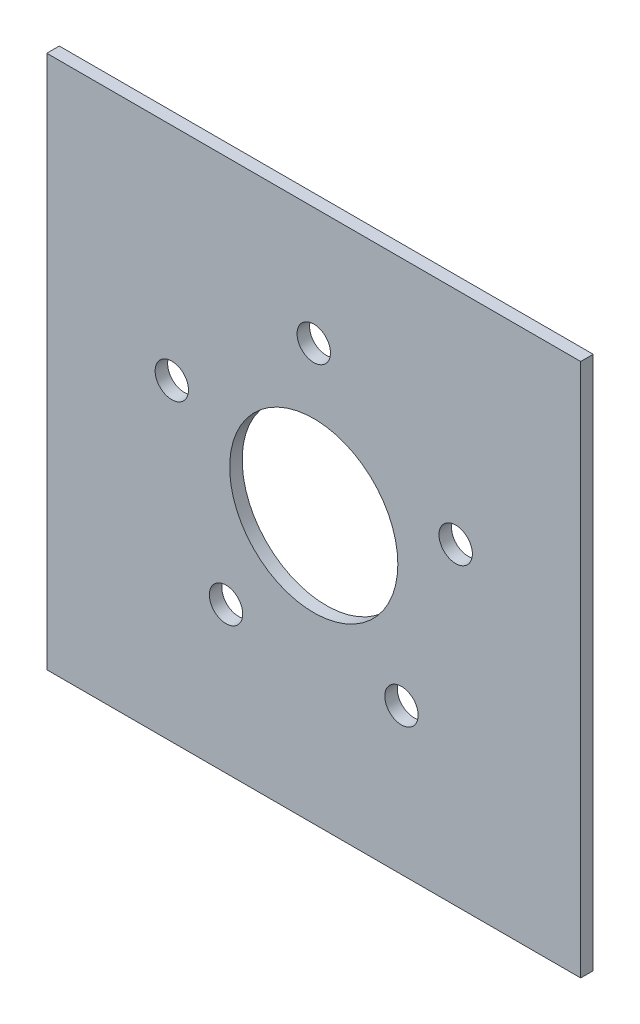
ISO-10303-21;
HEADER;
FILE_DESCRIPTION(('STEP AP214'),'2;1');
FILE_NAME('part.step','',(''),(''),'','','');
FILE_SCHEMA(('AUTOMOTIVE_DESIGN { 1 0 10303 214 1 1 1 1 }'));
ENDSEC;
DATA;
#1=APPLICATION_CONTEXT('core data for automotive mechanical design processes');
#2=APPLICATION_PROTOCOL_DEFINITION('international standard','automotive_design',2000,#1);
#3=PRODUCT_CONTEXT('',#1,'mechanical');
#4=PRODUCT('Part','Part','',(#3));
#5=PRODUCT_RELATED_PRODUCT_CATEGORY('part','',(#4));
#6=PRODUCT_DEFINITION_FORMATION('','',#4);
#7=PRODUCT_DEFINITION_CONTEXT('part definition',#1,'design');
#8=PRODUCT_DEFINITION('design','',#6,#7);
#9=PRODUCT_DEFINITION_SHAPE('','',#8);
#10=(LENGTH_UNIT() NAMED_UNIT(*) SI_UNIT(.MILLI.,.METRE.));
#11=(NAMED_UNIT(*) PLANE_ANGLE_UNIT() SI_UNIT($,.RADIAN.));
#12=(NAMED_UNIT(*) SI_UNIT($,.STERADIAN.) SOLID_ANGLE_UNIT());
#13=UNCERTAINTY_MEASURE_WITH_UNIT(LENGTH_MEASURE(1.E-05),#10,'distance_accuracy_value','');
#14=(GEOMETRIC_REPRESENTATION_CONTEXT(3) GLOBAL_UNCERTAINTY_ASSIGNED_CONTEXT((#13)) GLOBAL_UNIT_ASSIGNED_CONTEXT((#10,
#11,#12)) REPRESENTATION_CONTEXT('',''));
#15=CARTESIAN_POINT('',(0.,0.,0.));
#16=DIRECTION('',(0.,0.,1.));
#17=DIRECTION('',(1.,0.,0.));
#18=AXIS2_PLACEMENT_3D('',#15,#16,#17);
#19=CARTESIAN_POINT('',(-101.6,-101.6,4.7625));
#20=DIRECTION('',(0.,0.,-1.));
#21=DIRECTION('',(-1.,0.,0.));
#22=AXIS2_PLACEMENT_3D('',#19,#20,#21);
#23=PLANE('',#22);
#24=CARTESIAN_POINT('',(54.0189730319249,17.5518283083473,4.7625));
#25=DIRECTION('',(0.,0.,1.));
#26=DIRECTION('',(1.,0.,0.));
#27=AXIS2_PLACEMENT_3D('',#24,#25,#26);
#28=CIRCLE('',#27,6.35);
#29=CARTESIAN_POINT('',(60.3689730319249,17.5518283083473,4.7625));
#30=VERTEX_POINT('',#29);
#31=EDGE_CURVE('E167',#30,#30,#28,.T.);
#32=ORIENTED_EDGE('',*,*,#31,.F.);
#33=EDGE_LOOP('',(#32));
#34=FACE_BOUND('',#33,.T.);
#35=CARTESIAN_POINT('',(-33.3855613710934,-45.9512830759543,4.7625));
#36=DIRECTION('',(0.,0.,1.));
#37=DIRECTION('',(1.,0.,0.));
#38=AXIS2_PLACEMENT_3D('',#35,#36,#37);
#39=CIRCLE('',#38,6.35);
#40=CARTESIAN_POINT('',(-27.0355613710934,-45.9512830759543,4.7625));
#41=VERTEX_POINT('',#40);
#42=EDGE_CURVE('E151',#41,#41,#39,.T.);
#43=ORIENTED_EDGE('',*,*,#42,.F.);
#44=EDGE_LOOP('',(#43));
#45=FACE_BOUND('',#44,.T.);
#46=CARTESIAN_POINT('',(-54.0189730319252,17.5518283083465,4.7625));
#47=DIRECTION('',(0.,0.,1.));
#48=DIRECTION('',(1.,0.,0.));
#49=AXIS2_PLACEMENT_3D('',#46,#47,#48);
#50=CIRCLE('',#49,6.35);
#51=CARTESIAN_POINT('',(-47.6689730319252,17.5518283083465,4.7625));
#52=VERTEX_POINT('',#51);
#53=EDGE_CURVE('E121',#52,#52,#50,.T.);
#54=ORIENTED_EDGE('',*,*,#53,.F.);
#55=EDGE_LOOP('',(#54));
#56=FACE_BOUND('',#55,.T.);
#57=DIRECTION('',(0.,-1.,0.));
#58=VECTOR('',#57,1.);
#59=CARTESIAN_POINT('',(-101.6,101.6,4.7625));
#60=LINE('',#59,#58);
#61=CARTESIAN_POINT('',(-101.6,101.6,4.7625));
#62=VERTEX_POINT('',#61);
#63=CARTESIAN_POINT('',(-101.6,-101.6,4.7625));
#64=VERTEX_POINT('',#63);
#65=EDGE_CURVE('E100',#62,#64,#60,.T.);
#66=ORIENTED_EDGE('',*,*,#65,.T.);
#67=DIRECTION('',(1.,0.,0.));
#68=VECTOR('',#67,1.);
#69=CARTESIAN_POINT('',(101.6,-101.6,4.7625));
#70=LINE('',#69,#68);
#71=CARTESIAN_POINT('',(101.6,-101.6,4.7625));
#72=VERTEX_POINT('',#71);
#73=EDGE_CURVE('E94',#64,#72,#70,.T.);
#74=ORIENTED_EDGE('',*,*,#73,.T.);
#75=DIRECTION('',(0.,1.,0.));
#76=VECTOR('',#75,1.);
#77=CARTESIAN_POINT('',(101.6,101.6,4.7625));
#78=LINE('',#77,#76);
#79=CARTESIAN_POINT('',(101.6,101.6,4.7625));
#80=VERTEX_POINT('',#79);
#81=EDGE_CURVE('E98',#72,#80,#78,.T.);
#82=ORIENTED_EDGE('',*,*,#81,.T.);
#83=DIRECTION('',(-1.,0.,0.));
#84=VECTOR('',#83,1.);
#85=CARTESIAN_POINT('',(101.6,101.6,4.7625));
#86=LINE('',#85,#84);
#87=EDGE_CURVE('E60',#80,#62,#86,.T.);
#88=ORIENTED_EDGE('',*,*,#87,.T.);
#89=EDGE_LOOP('',(#66,#74,#82,#88));
#90=FACE_BOUND('',#89,.T.);
#91=CARTESIAN_POINT('',(0.,56.798909535215,4.7625));
#92=DIRECTION('',(0.,0.,1.));
#93=DIRECTION('',(1.,0.,0.));
#94=AXIS2_PLACEMENT_3D('',#91,#92,#93);
#95=CIRCLE('',#94,6.35);
#96=CARTESIAN_POINT('',(6.35,56.798909535215,4.7625));
#97=VERTEX_POINT('',#96);
#98=EDGE_CURVE('E143',#97,#97,#95,.T.);
#99=ORIENTED_EDGE('',*,*,#98,.F.);
#100=EDGE_LOOP('',(#99));
#101=FACE_BOUND('',#100,.T.);
#102=CARTESIAN_POINT('',(33.3855613710941,-45.9512830759539,4.7625));
#103=DIRECTION('',(0.,0.,1.));
#104=DIRECTION('',(1.,0.,0.));
#105=AXIS2_PLACEMENT_3D('',#102,#103,#104);
#106=CIRCLE('',#105,6.35);
#107=CARTESIAN_POINT('',(39.7355613710941,-45.9512830759539,4.7625));
#108=VERTEX_POINT('',#107);
#109=EDGE_CURVE('E159',#108,#108,#106,.T.);
#110=ORIENTED_EDGE('',*,*,#109,.F.);
#111=EDGE_LOOP('',(#110));
#112=FACE_BOUND('',#111,.T.);
#113=CARTESIAN_POINT('',(0.,0.,4.7625));
#114=DIRECTION('',(0.,0.,1.));
#115=DIRECTION('',(1.,0.,0.));
#116=AXIS2_PLACEMENT_3D('',#113,#114,#115);
#117=CIRCLE('',#116,32.004);
#118=CARTESIAN_POINT('',(32.004,0.,4.7625));
#119=VERTEX_POINT('',#118);
#120=EDGE_CURVE('E175',#119,#119,#117,.T.);
#121=ORIENTED_EDGE('',*,*,#120,.F.);
#122=EDGE_LOOP('',(#121));
#123=FACE_BOUND('',#122,.T.);
#124=ADVANCED_FACE('F39',(#34,#45,#56,#90,#101,#112,#123),#23,.F.);
#125=CARTESIAN_POINT('',(-101.6,-101.6,0.));
#126=DIRECTION('',(0.,0.,-1.));
#127=DIRECTION('',(-1.,0.,0.));
#128=AXIS2_PLACEMENT_3D('',#125,#126,#127);
#129=PLANE('',#128);
#130=CARTESIAN_POINT('',(54.0189730319249,17.5518283083473,0.));
#131=DIRECTION('',(0.,0.,1.));
#132=DIRECTION('',(1.,0.,0.));
#133=AXIS2_PLACEMENT_3D('',#130,#131,#132);
#134=CIRCLE('',#133,6.35);
#135=CARTESIAN_POINT('',(60.3689730319249,17.5518283083473,0.));
#136=VERTEX_POINT('',#135);
#137=EDGE_CURVE('E171',#136,#136,#134,.T.);
#138=ORIENTED_EDGE('',*,*,#137,.T.);
#139=EDGE_LOOP('',(#138));
#140=FACE_BOUND('',#139,.T.);
#141=CARTESIAN_POINT('',(-33.3855613710934,-45.9512830759543,0.));
#142=DIRECTION('',(0.,0.,1.));
#143=DIRECTION('',(1.,0.,0.));
#144=AXIS2_PLACEMENT_3D('',#141,#142,#143);
#145=CIRCLE('',#144,6.35);
#146=CARTESIAN_POINT('',(-27.0355613710934,-45.9512830759543,0.));
#147=VERTEX_POINT('',#146);
#148=EDGE_CURVE('E155',#147,#147,#145,.T.);
#149=ORIENTED_EDGE('',*,*,#148,.T.);
#150=EDGE_LOOP('',(#149));
#151=FACE_BOUND('',#150,.T.);
#152=CARTESIAN_POINT('',(-54.0189730319252,17.5518283083465,0.));
#153=DIRECTION('',(0.,0.,1.));
#154=DIRECTION('',(1.,0.,0.));
#155=AXIS2_PLACEMENT_3D('',#152,#153,#154);
#156=CIRCLE('',#155,6.35);
#157=CARTESIAN_POINT('',(-47.6689730319252,17.5518283083465,0.));
#158=VERTEX_POINT('',#157);
#159=EDGE_CURVE('E139',#158,#158,#156,.T.);
#160=ORIENTED_EDGE('',*,*,#159,.T.);
#161=EDGE_LOOP('',(#160));
#162=FACE_BOUND('',#161,.T.);
#163=DIRECTION('',(0.,-1.,0.));
#164=VECTOR('',#163,1.);
#165=CARTESIAN_POINT('',(-101.6,101.6,0.));
#166=LINE('',#165,#164);
#167=CARTESIAN_POINT('',(-101.6,101.6,0.));
#168=VERTEX_POINT('',#167);
#169=CARTESIAN_POINT('',(-101.6,-101.6,0.));
#170=VERTEX_POINT('',#169);
#171=EDGE_CURVE('E117',#168,#170,#166,.T.);
#172=ORIENTED_EDGE('',*,*,#171,.F.);
#173=DIRECTION('',(-1.,0.,0.));
#174=VECTOR('',#173,1.);
#175=CARTESIAN_POINT('',(101.6,101.6,0.));
#176=LINE('',#175,#174);
#177=CARTESIAN_POINT('',(101.6,101.6,0.));
#178=VERTEX_POINT('',#177);
#179=EDGE_CURVE('E87',#178,#168,#176,.T.);
#180=ORIENTED_EDGE('',*,*,#179,.F.);
#181=DIRECTION('',(0.,1.,0.));
#182=VECTOR('',#181,1.);
#183=CARTESIAN_POINT('',(101.6,101.6,0.));
#184=LINE('',#183,#182);
#185=CARTESIAN_POINT('',(101.6,-101.6,0.));
#186=VERTEX_POINT('',#185);
#187=EDGE_CURVE('E81',#186,#178,#184,.T.);
#188=ORIENTED_EDGE('',*,*,#187,.F.);
#189=DIRECTION('',(1.,0.,0.));
#190=VECTOR('',#189,1.);
#191=CARTESIAN_POINT('',(101.6,-101.6,0.));
#192=LINE('',#191,#190);
#193=EDGE_CURVE('E105',#170,#186,#192,.T.);
#194=ORIENTED_EDGE('',*,*,#193,.F.);
#195=EDGE_LOOP('',(#172,#180,#188,#194));
#196=FACE_BOUND('',#195,.T.);
#197=CARTESIAN_POINT('',(0.,56.798909535215,0.));
#198=DIRECTION('',(0.,0.,1.));
#199=DIRECTION('',(1.,0.,0.));
#200=AXIS2_PLACEMENT_3D('',#197,#198,#199);
#201=CIRCLE('',#200,6.35);
#202=CARTESIAN_POINT('',(6.35,56.798909535215,0.));
#203=VERTEX_POINT('',#202);
#204=EDGE_CURVE('E147',#203,#203,#201,.T.);
#205=ORIENTED_EDGE('',*,*,#204,.T.);
#206=EDGE_LOOP('',(#205));
#207=FACE_BOUND('',#206,.T.);
#208=CARTESIAN_POINT('',(33.3855613710941,-45.9512830759539,0.));
#209=DIRECTION('',(0.,0.,1.));
#210=DIRECTION('',(1.,0.,0.));
#211=AXIS2_PLACEMENT_3D('',#208,#209,#210);
#212=CIRCLE('',#211,6.35);
#213=CARTESIAN_POINT('',(39.7355613710941,-45.9512830759539,0.));
#214=VERTEX_POINT('',#213);
#215=EDGE_CURVE('E163',#214,#214,#212,.T.);
#216=ORIENTED_EDGE('',*,*,#215,.T.);
#217=EDGE_LOOP('',(#216));
#218=FACE_BOUND('',#217,.T.);
#219=CARTESIAN_POINT('',(0.,0.,0.));
#220=DIRECTION('',(0.,0.,1.));
#221=DIRECTION('',(1.,0.,0.));
#222=AXIS2_PLACEMENT_3D('',#219,#220,#221);
#223=CIRCLE('',#222,32.004);
#224=CARTESIAN_POINT('',(32.004,0.,0.));
#225=VERTEX_POINT('',#224);
#226=EDGE_CURVE('E178',#225,#225,#223,.T.);
#227=ORIENTED_EDGE('',*,*,#226,.T.);
#228=EDGE_LOOP('',(#227));
#229=FACE_BOUND('',#228,.T.);
#230=ADVANCED_FACE('F134',(#140,#151,#162,#196,#207,#218,#229),#129,.T.);
#231=CARTESIAN_POINT('',(-101.6,101.6,4.7625));
#232=DIRECTION('',(1.,0.,0.));
#233=DIRECTION('',(0.,1.,0.));
#234=AXIS2_PLACEMENT_3D('',#231,#232,#233);
#235=PLANE('',#234);
#236=ORIENTED_EDGE('',*,*,#171,.T.);
#237=DIRECTION('',(0.,0.,-1.));
#238=VECTOR('',#237,1.);
#239=CARTESIAN_POINT('',(-101.6,-101.6,4.7625));
#240=LINE('',#239,#238);
#241=EDGE_CURVE('E11',#64,#170,#240,.T.);
#242=ORIENTED_EDGE('',*,*,#241,.F.);
#243=ORIENTED_EDGE('',*,*,#65,.F.);
#244=DIRECTION('',(0.,0.,-1.));
#245=VECTOR('',#244,1.);
#246=CARTESIAN_POINT('',(-101.6,101.6,4.7625));
#247=LINE('',#246,#245);
#248=EDGE_CURVE('E113',#62,#168,#247,.T.);
#249=ORIENTED_EDGE('',*,*,#248,.T.);
#250=EDGE_LOOP('',(#236,#242,#243,#249));
#251=FACE_BOUND('',#250,.T.);
#252=ADVANCED_FACE('F41',(#251),#235,.F.);
#253=CARTESIAN_POINT('',(101.6,-101.6,4.7625));
#254=DIRECTION('',(0.,1.,0.));
#255=DIRECTION('',(-1.,0.,0.));
#256=AXIS2_PLACEMENT_3D('',#253,#254,#255);
#257=PLANE('',#256);
#258=ORIENTED_EDGE('',*,*,#193,.T.);
#259=DIRECTION('',(0.,0.,-1.));
#260=VECTOR('',#259,1.);
#261=CARTESIAN_POINT('',(101.6,-101.6,4.7625));
#262=LINE('',#261,#260);
#263=EDGE_CURVE('E49',#72,#186,#262,.T.);
#264=ORIENTED_EDGE('',*,*,#263,.F.);
#265=ORIENTED_EDGE('',*,*,#73,.F.);
#266=ORIENTED_EDGE('',*,*,#241,.T.);
#267=EDGE_LOOP('',(#258,#264,#265,#266));
#268=FACE_BOUND('',#267,.T.);
#269=ADVANCED_FACE('F104',(#268),#257,.F.);
#270=CARTESIAN_POINT('',(101.6,101.6,4.7625));
#271=DIRECTION('',(-1.,0.,0.));
#272=DIRECTION('',(0.,-1.,0.));
#273=AXIS2_PLACEMENT_3D('',#270,#271,#272);
#274=PLANE('',#273);
#275=ORIENTED_EDGE('',*,*,#187,.T.);
#276=DIRECTION('',(0.,0.,-1.));
#277=VECTOR('',#276,1.);
#278=CARTESIAN_POINT('',(101.6,101.6,4.7625));
#279=LINE('',#278,#277);
#280=EDGE_CURVE('E107',#80,#178,#279,.T.);
#281=ORIENTED_EDGE('',*,*,#280,.F.);
#282=ORIENTED_EDGE('',*,*,#81,.F.);
#283=ORIENTED_EDGE('',*,*,#263,.T.);
#284=EDGE_LOOP('',(#275,#281,#282,#283));
#285=FACE_BOUND('',#284,.T.);
#286=ADVANCED_FACE('F108',(#285),#274,.F.);
#287=CARTESIAN_POINT('',(101.6,101.6,4.7625));
#288=DIRECTION('',(0.,-1.,0.));
#289=DIRECTION('',(1.,0.,0.));
#290=AXIS2_PLACEMENT_3D('',#287,#288,#289);
#291=PLANE('',#290);
#292=ORIENTED_EDGE('',*,*,#179,.T.);
#293=ORIENTED_EDGE('',*,*,#248,.F.);
#294=ORIENTED_EDGE('',*,*,#87,.F.);
#295=ORIENTED_EDGE('',*,*,#280,.T.);
#296=EDGE_LOOP('',(#292,#293,#294,#295));
#297=FACE_BOUND('',#296,.T.);
#298=ADVANCED_FACE('F131',(#297),#291,.F.);
#299=CARTESIAN_POINT('',(-54.0189730319252,17.5518283083465,4.7625));
#300=DIRECTION('',(0.,0.,-1.));
#301=DIRECTION('',(-1.,0.,0.));
#302=AXIS2_PLACEMENT_3D('',#299,#300,#301);
#303=CYLINDRICAL_SURFACE('',#302,6.35);
#304=ORIENTED_EDGE('',*,*,#53,.T.);
#305=EDGE_LOOP('',(#304));
#306=FACE_BOUND('',#305,.T.);
#307=ORIENTED_EDGE('',*,*,#159,.F.);
#308=EDGE_LOOP('',(#307));
#309=FACE_BOUND('',#308,.T.);
#310=ADVANCED_FACE('F200',(#306,#309),#303,.F.);
#311=CARTESIAN_POINT('',(0.,56.798909535215,4.7625));
#312=DIRECTION('',(0.,0.,-1.));
#313=DIRECTION('',(-1.,0.,0.));
#314=AXIS2_PLACEMENT_3D('',#311,#312,#313);
#315=CYLINDRICAL_SURFACE('',#314,6.35);
#316=ORIENTED_EDGE('',*,*,#98,.T.);
#317=EDGE_LOOP('',(#316));
#318=FACE_BOUND('',#317,.T.);
#319=ORIENTED_EDGE('',*,*,#204,.F.);
#320=EDGE_LOOP('',(#319));
#321=FACE_BOUND('',#320,.T.);
#322=ADVANCED_FACE('F252',(#318,#321),#315,.F.);
#323=CARTESIAN_POINT('',(-33.3855613710934,-45.9512830759543,4.7625));
#324=DIRECTION('',(0.,0.,-1.));
#325=DIRECTION('',(-1.,0.,0.));
#326=AXIS2_PLACEMENT_3D('',#323,#324,#325);
#327=CYLINDRICAL_SURFACE('',#326,6.35);
#328=ORIENTED_EDGE('',*,*,#42,.T.);
#329=EDGE_LOOP('',(#328));
#330=FACE_BOUND('',#329,.T.);
#331=ORIENTED_EDGE('',*,*,#148,.F.);
#332=EDGE_LOOP('',(#331));
#333=FACE_BOUND('',#332,.T.);
#334=ADVANCED_FACE('F260',(#330,#333),#327,.F.);
#335=CARTESIAN_POINT('',(33.3855613710941,-45.9512830759539,4.7625));
#336=DIRECTION('',(0.,0.,-1.));
#337=DIRECTION('',(-1.,0.,0.));
#338=AXIS2_PLACEMENT_3D('',#335,#336,#337);
#339=CYLINDRICAL_SURFACE('',#338,6.35);
#340=ORIENTED_EDGE('',*,*,#109,.T.);
#341=EDGE_LOOP('',(#340));
#342=FACE_BOUND('',#341,.T.);
#343=ORIENTED_EDGE('',*,*,#215,.F.);
#344=EDGE_LOOP('',(#343));
#345=FACE_BOUND('',#344,.T.);
#346=ADVANCED_FACE('F268',(#342,#345),#339,.F.);
#347=CARTESIAN_POINT('',(54.0189730319249,17.5518283083473,4.7625));
#348=DIRECTION('',(0.,0.,-1.));
#349=DIRECTION('',(-1.,0.,0.));
#350=AXIS2_PLACEMENT_3D('',#347,#348,#349);
#351=CYLINDRICAL_SURFACE('',#350,6.35);
#352=ORIENTED_EDGE('',*,*,#31,.T.);
#353=EDGE_LOOP('',(#352));
#354=FACE_BOUND('',#353,.T.);
#355=ORIENTED_EDGE('',*,*,#137,.F.);
#356=EDGE_LOOP('',(#355));
#357=FACE_BOUND('',#356,.T.);
#358=ADVANCED_FACE('F277',(#354,#357),#351,.F.);
#359=CARTESIAN_POINT('',(0.,0.,4.7625));
#360=DIRECTION('',(0.,0.,-1.));
#361=DIRECTION('',(-1.,0.,0.));
#362=AXIS2_PLACEMENT_3D('',#359,#360,#361);
#363=CYLINDRICAL_SURFACE('',#362,32.004);
#364=ORIENTED_EDGE('',*,*,#120,.T.);
#365=EDGE_LOOP('',(#364));
#366=FACE_BOUND('',#365,.T.);
#367=ORIENTED_EDGE('',*,*,#226,.F.);
#368=EDGE_LOOP('',(#367));
#369=FACE_BOUND('',#368,.T.);
#370=ADVANCED_FACE('F186',(#366,#369),#363,.F.);
#371=CLOSED_SHELL('',(#124,#230,#252,#269,#286,#298,#310,#322,#334,#346,#358,#370));
#372=MANIFOLD_SOLID_BREP('B2',#371);
#373=ADVANCED_BREP_SHAPE_REPRESENTATION('',(#18,#372),#14);
#374=SHAPE_DEFINITION_REPRESENTATION(#9,#373);
ENDSEC;
END-ISO-10303-21;
